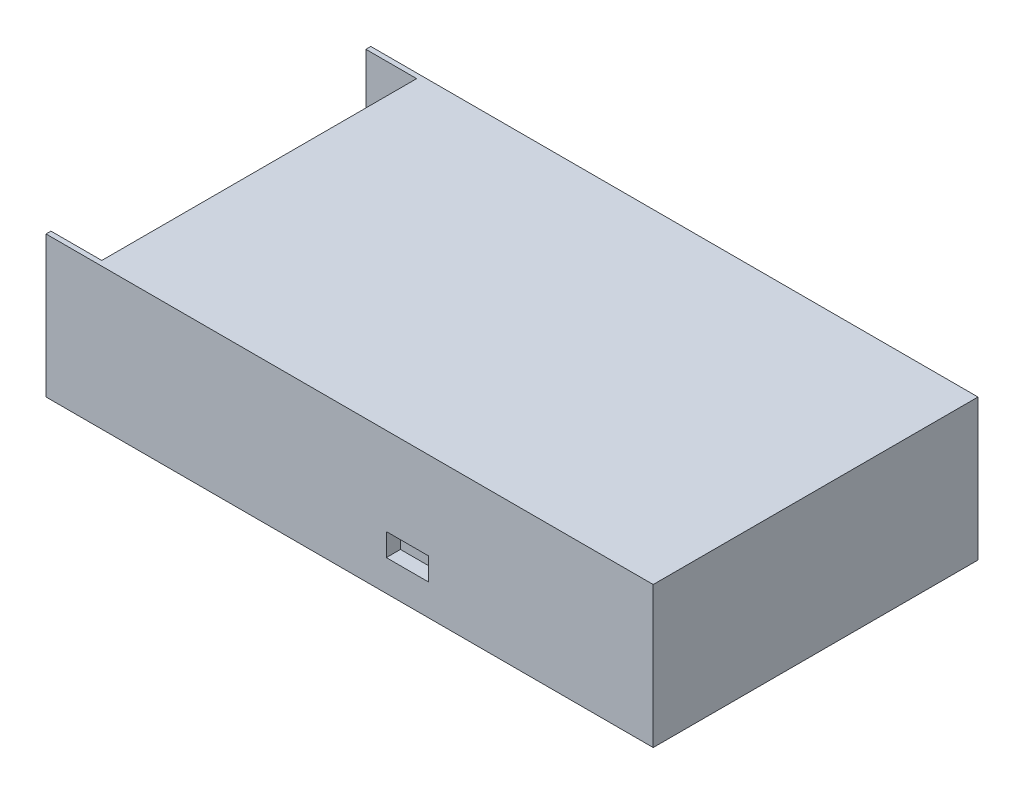
ISO-10303-21;
HEADER;
FILE_DESCRIPTION(('STEP AP214'),'2;1');
FILE_NAME('part.step','',(''),(''),'','','');
FILE_SCHEMA(('AUTOMOTIVE_DESIGN { 1 0 10303 214 1 1 1 1 }'));
ENDSEC;
DATA;
#1=APPLICATION_CONTEXT('core data for automotive mechanical design processes');
#2=APPLICATION_PROTOCOL_DEFINITION('international standard','automotive_design',2000,#1);
#3=PRODUCT_CONTEXT('',#1,'mechanical');
#4=PRODUCT('Part','Part','',(#3));
#5=PRODUCT_RELATED_PRODUCT_CATEGORY('part','',(#4));
#6=PRODUCT_DEFINITION_FORMATION('','',#4);
#7=PRODUCT_DEFINITION_CONTEXT('part definition',#1,'design');
#8=PRODUCT_DEFINITION('design','',#6,#7);
#9=PRODUCT_DEFINITION_SHAPE('','',#8);
#10=(LENGTH_UNIT() NAMED_UNIT(*) SI_UNIT(.MILLI.,.METRE.));
#11=(NAMED_UNIT(*) PLANE_ANGLE_UNIT() SI_UNIT($,.RADIAN.));
#12=(NAMED_UNIT(*) SI_UNIT($,.STERADIAN.) SOLID_ANGLE_UNIT());
#13=UNCERTAINTY_MEASURE_WITH_UNIT(LENGTH_MEASURE(1.E-05),#10,'distance_accuracy_value','');
#14=(GEOMETRIC_REPRESENTATION_CONTEXT(3) GLOBAL_UNCERTAINTY_ASSIGNED_CONTEXT((#13)) GLOBAL_UNIT_ASSIGNED_CONTEXT((#10,
#11,#12)) REPRESENTATION_CONTEXT('',''));
#15=CARTESIAN_POINT('',(0.,0.,0.));
#16=DIRECTION('',(0.,0.,1.));
#17=DIRECTION('',(1.,0.,0.));
#18=AXIS2_PLACEMENT_3D('',#15,#16,#17);
#19=CARTESIAN_POINT('',(-107.5,50.,-57.5));
#20=DIRECTION('',(1.,0.,0.));
#21=DIRECTION('',(0.,0.,-1.));
#22=AXIS2_PLACEMENT_3D('',#19,#20,#21);
#23=PLANE('',#22);
#24=DIRECTION('',(0.,0.,-1.));
#25=VECTOR('',#24,1.);
#26=CARTESIAN_POINT('',(-107.5,8.74999999999999,-55.75));
#27=LINE('',#26,#25);
#28=CARTESIAN_POINT('',(-107.5,8.74999999999999,55.75));
#29=VERTEX_POINT('',#28);
#30=CARTESIAN_POINT('',(-107.5,8.74999999999999,-55.75));
#31=VERTEX_POINT('',#30);
#32=EDGE_CURVE('E192',#29,#31,#27,.T.);
#33=ORIENTED_EDGE('',*,*,#32,.T.);
#34=DIRECTION('',(0.,1.,0.));
#35=VECTOR('',#34,1.);
#36=CARTESIAN_POINT('',(-107.5,-112.943569980765,-55.75));
#37=LINE('',#36,#35);
#38=CARTESIAN_POINT('',(-107.5,50.,-55.75));
#39=VERTEX_POINT('',#38);
#40=EDGE_CURVE('E190',#31,#39,#37,.T.);
#41=ORIENTED_EDGE('',*,*,#40,.T.);
#42=DIRECTION('',(0.,0.,1.));
#43=VECTOR('',#42,1.);
#44=CARTESIAN_POINT('',(-107.5,50.,-57.5));
#45=LINE('',#44,#43);
#46=CARTESIAN_POINT('',(-107.5,50.,-57.5));
#47=VERTEX_POINT('',#46);
#48=EDGE_CURVE('E211',#47,#39,#45,.T.);
#49=ORIENTED_EDGE('',*,*,#48,.F.);
#50=DIRECTION('',(0.,-1.,0.));
#51=VECTOR('',#50,1.);
#52=CARTESIAN_POINT('',(-107.5,50.,-57.5));
#53=LINE('',#52,#51);
#54=CARTESIAN_POINT('',(-107.5,0.,-57.5));
#55=VERTEX_POINT('',#54);
#56=EDGE_CURVE('E221',#47,#55,#53,.T.);
#57=ORIENTED_EDGE('',*,*,#56,.T.);
#58=DIRECTION('',(0.,0.,1.));
#59=VECTOR('',#58,1.);
#60=CARTESIAN_POINT('',(-107.5,0.,-57.5));
#61=LINE('',#60,#59);
#62=CARTESIAN_POINT('',(-107.5,0.,57.5));
#63=VERTEX_POINT('',#62);
#64=EDGE_CURVE('E210',#55,#63,#61,.T.);
#65=ORIENTED_EDGE('',*,*,#64,.T.);
#66=DIRECTION('',(0.,-1.,0.));
#67=VECTOR('',#66,1.);
#68=CARTESIAN_POINT('',(-107.5,50.,57.5));
#69=LINE('',#68,#67);
#70=CARTESIAN_POINT('',(-107.5,50.,57.5));
#71=VERTEX_POINT('',#70);
#72=EDGE_CURVE('E12',#71,#63,#69,.T.);
#73=ORIENTED_EDGE('',*,*,#72,.F.);
#74=CARTESIAN_POINT('',(-107.5,50.,55.75));
#75=VERTEX_POINT('',#74);
#76=EDGE_CURVE('E215',#75,#71,#45,.T.);
#77=ORIENTED_EDGE('',*,*,#76,.F.);
#78=DIRECTION('',(0.,1.,0.));
#79=VECTOR('',#78,1.);
#80=CARTESIAN_POINT('',(-107.5,-112.943569980765,55.75));
#81=LINE('',#80,#79);
#82=EDGE_CURVE('E57',#29,#75,#81,.T.);
#83=ORIENTED_EDGE('',*,*,#82,.F.);
#84=EDGE_LOOP('',(#33,#41,#49,#57,#65,#73,#77,#83));
#85=FACE_BOUND('',#84,.T.);
#86=ADVANCED_FACE('F35',(#85),#23,.F.);
#87=CARTESIAN_POINT('',(-107.5,50.,57.5));
#88=DIRECTION('',(0.,0.,-1.));
#89=DIRECTION('',(-1.,0.,0.));
#90=AXIS2_PLACEMENT_3D('',#87,#88,#89);
#91=PLANE('',#90);
#92=DIRECTION('',(1.,0.,0.));
#93=VECTOR('',#92,1.);
#94=CARTESIAN_POINT('',(13.,11.,57.5));
#95=LINE('',#94,#93);
#96=CARTESIAN_POINT('',(13.,11.,57.5));
#97=VERTEX_POINT('',#96);
#98=CARTESIAN_POINT('',(28.,11.,57.5));
#99=VERTEX_POINT('',#98);
#100=EDGE_CURVE('E153',#97,#99,#95,.T.);
#101=ORIENTED_EDGE('',*,*,#100,.F.);
#102=DIRECTION('',(0.,-1.,0.));
#103=VECTOR('',#102,1.);
#104=CARTESIAN_POINT('',(13.,19.,57.5));
#105=LINE('',#104,#103);
#106=CARTESIAN_POINT('',(13.,19.,57.5));
#107=VERTEX_POINT('',#106);
#108=EDGE_CURVE('E49',#107,#97,#105,.T.);
#109=ORIENTED_EDGE('',*,*,#108,.F.);
#110=DIRECTION('',(-1.,0.,0.));
#111=VECTOR('',#110,1.);
#112=CARTESIAN_POINT('',(13.,19.,57.5));
#113=LINE('',#112,#111);
#114=CARTESIAN_POINT('',(28.,19.,57.5));
#115=VERTEX_POINT('',#114);
#116=EDGE_CURVE('E144',#115,#107,#113,.T.);
#117=ORIENTED_EDGE('',*,*,#116,.F.);
#118=DIRECTION('',(0.,1.,0.));
#119=VECTOR('',#118,1.);
#120=CARTESIAN_POINT('',(28.,19.,57.5));
#121=LINE('',#120,#119);
#122=EDGE_CURVE('E147',#99,#115,#121,.T.);
#123=ORIENTED_EDGE('',*,*,#122,.F.);
#124=EDGE_LOOP('',(#101,#109,#117,#123));
#125=FACE_BOUND('',#124,.T.);
#126=DIRECTION('',(1.,0.,0.));
#127=VECTOR('',#126,1.);
#128=CARTESIAN_POINT('',(-107.5,0.,57.5));
#129=LINE('',#128,#127);
#130=CARTESIAN_POINT('',(107.5,0.,57.5));
#131=VERTEX_POINT('',#130);
#132=EDGE_CURVE('E224',#63,#131,#129,.T.);
#133=ORIENTED_EDGE('',*,*,#132,.T.);
#134=DIRECTION('',(0.,-1.,0.));
#135=VECTOR('',#134,1.);
#136=CARTESIAN_POINT('',(107.5,50.,57.5));
#137=LINE('',#136,#135);
#138=CARTESIAN_POINT('',(107.5,50.,57.5));
#139=VERTEX_POINT('',#138);
#140=EDGE_CURVE('E42',#139,#131,#137,.T.);
#141=ORIENTED_EDGE('',*,*,#140,.F.);
#142=DIRECTION('',(1.,0.,0.));
#143=VECTOR('',#142,1.);
#144=CARTESIAN_POINT('',(-107.5,50.,57.5));
#145=LINE('',#144,#143);
#146=EDGE_CURVE('E214',#71,#139,#145,.T.);
#147=ORIENTED_EDGE('',*,*,#146,.F.);
#148=ORIENTED_EDGE('',*,*,#72,.T.);
#149=EDGE_LOOP('',(#133,#141,#147,#148));
#150=FACE_BOUND('',#149,.T.);
#151=ADVANCED_FACE('F260',(#125,#150),#91,.F.);
#152=CARTESIAN_POINT('',(107.5,50.,-57.5));
#153=DIRECTION('',(-1.,0.,0.));
#154=DIRECTION('',(0.,0.,1.));
#155=AXIS2_PLACEMENT_3D('',#152,#153,#154);
#156=PLANE('',#155);
#157=DIRECTION('',(0.,0.,-1.));
#158=VECTOR('',#157,1.);
#159=CARTESIAN_POINT('',(107.5,0.,-57.5));
#160=LINE('',#159,#158);
#161=CARTESIAN_POINT('',(107.5,0.,-57.5));
#162=VERTEX_POINT('',#161);
#163=EDGE_CURVE('E226',#131,#162,#160,.T.);
#164=ORIENTED_EDGE('',*,*,#163,.T.);
#165=DIRECTION('',(0.,-1.,0.));
#166=VECTOR('',#165,1.);
#167=CARTESIAN_POINT('',(107.5,50.,-57.5));
#168=LINE('',#167,#166);
#169=CARTESIAN_POINT('',(107.5,50.,-57.5));
#170=VERTEX_POINT('',#169);
#171=EDGE_CURVE('E232',#170,#162,#168,.T.);
#172=ORIENTED_EDGE('',*,*,#171,.F.);
#173=DIRECTION('',(0.,0.,-1.));
#174=VECTOR('',#173,1.);
#175=CARTESIAN_POINT('',(107.5,50.,-57.5));
#176=LINE('',#175,#174);
#177=EDGE_CURVE('E217',#139,#170,#176,.T.);
#178=ORIENTED_EDGE('',*,*,#177,.F.);
#179=ORIENTED_EDGE('',*,*,#140,.T.);
#180=EDGE_LOOP('',(#164,#172,#178,#179));
#181=FACE_BOUND('',#180,.T.);
#182=ADVANCED_FACE('F239',(#181),#156,.F.);
#183=CARTESIAN_POINT('',(-107.5,50.,-57.5));
#184=DIRECTION('',(0.,0.,1.));
#185=DIRECTION('',(1.,0.,0.));
#186=AXIS2_PLACEMENT_3D('',#183,#184,#185);
#187=PLANE('',#186);
#188=DIRECTION('',(-1.,0.,0.));
#189=VECTOR('',#188,1.);
#190=CARTESIAN_POINT('',(-107.5,0.,-57.5));
#191=LINE('',#190,#189);
#192=EDGE_CURVE('E228',#162,#55,#191,.T.);
#193=ORIENTED_EDGE('',*,*,#192,.T.);
#194=ORIENTED_EDGE('',*,*,#56,.F.);
#195=DIRECTION('',(-1.,0.,0.));
#196=VECTOR('',#195,1.);
#197=CARTESIAN_POINT('',(-107.5,50.,-57.5));
#198=LINE('',#197,#196);
#199=EDGE_CURVE('E219',#170,#47,#198,.T.);
#200=ORIENTED_EDGE('',*,*,#199,.F.);
#201=ORIENTED_EDGE('',*,*,#171,.T.);
#202=EDGE_LOOP('',(#193,#194,#200,#201));
#203=FACE_BOUND('',#202,.T.);
#204=ADVANCED_FACE('F249',(#203),#187,.F.);
#205=CARTESIAN_POINT('',(-107.5,50.,57.5));
#206=DIRECTION('',(0.,1.,0.));
#207=DIRECTION('',(0.,0.,1.));
#208=AXIS2_PLACEMENT_3D('',#205,#206,#207);
#209=PLANE('',#208);
#210=DIRECTION('',(-1.,0.,0.));
#211=VECTOR('',#210,1.);
#212=CARTESIAN_POINT('',(-107.5,50.,-55.75));
#213=LINE('',#212,#211);
#214=CARTESIAN_POINT('',(-89.5,50.,-55.75));
#215=VERTEX_POINT('',#214);
#216=EDGE_CURVE('E200',#215,#39,#213,.T.);
#217=ORIENTED_EDGE('',*,*,#216,.F.);
#218=DIRECTION('',(0.,0.,-1.));
#219=VECTOR('',#218,1.);
#220=CARTESIAN_POINT('',(-89.5,50.,-55.75));
#221=LINE('',#220,#219);
#222=CARTESIAN_POINT('',(-89.5,50.,55.75));
#223=VERTEX_POINT('',#222);
#224=EDGE_CURVE('E197',#223,#215,#221,.T.);
#225=ORIENTED_EDGE('',*,*,#224,.F.);
#226=DIRECTION('',(1.,0.,0.));
#227=VECTOR('',#226,1.);
#228=CARTESIAN_POINT('',(-107.5,50.,55.75));
#229=LINE('',#228,#227);
#230=EDGE_CURVE('E184',#75,#223,#229,.T.);
#231=ORIENTED_EDGE('',*,*,#230,.F.);
#232=ORIENTED_EDGE('',*,*,#76,.T.);
#233=ORIENTED_EDGE('',*,*,#146,.T.);
#234=ORIENTED_EDGE('',*,*,#177,.T.);
#235=ORIENTED_EDGE('',*,*,#199,.T.);
#236=ORIENTED_EDGE('',*,*,#48,.T.);
#237=EDGE_LOOP('',(#217,#225,#231,#232,#233,#234,#235,#236));
#238=FACE_BOUND('',#237,.T.);
#239=ADVANCED_FACE('F257',(#238),#209,.T.);
#240=CARTESIAN_POINT('',(-107.5,0.,57.5));
#241=DIRECTION('',(0.,1.,0.));
#242=DIRECTION('',(0.,0.,1.));
#243=AXIS2_PLACEMENT_3D('',#240,#241,#242);
#244=PLANE('',#243);
#245=CARTESIAN_POINT('',(75.,0.,25.));
#246=DIRECTION('',(0.,-1.,0.));
#247=DIRECTION('',(0.,0.,-1.));
#248=AXIS2_PLACEMENT_3D('',#245,#246,#247);
#249=CIRCLE('',#248,2.);
#250=CARTESIAN_POINT('',(75.,0.,23.));
#251=VERTEX_POINT('',#250);
#252=EDGE_CURVE('E159',#251,#251,#249,.T.);
#253=ORIENTED_EDGE('',*,*,#252,.F.);
#254=EDGE_LOOP('',(#253));
#255=FACE_BOUND('',#254,.T.);
#256=CARTESIAN_POINT('',(75.,0.,-25.));
#257=DIRECTION('',(0.,-1.,0.));
#258=DIRECTION('',(0.,0.,-1.));
#259=AXIS2_PLACEMENT_3D('',#256,#257,#258);
#260=CIRCLE('',#259,2.);
#261=CARTESIAN_POINT('',(75.,0.,-27.));
#262=VERTEX_POINT('',#261);
#263=EDGE_CURVE('E166',#262,#262,#260,.T.);
#264=ORIENTED_EDGE('',*,*,#263,.F.);
#265=EDGE_LOOP('',(#264));
#266=FACE_BOUND('',#265,.T.);
#267=CARTESIAN_POINT('',(-75.,0.,25.));
#268=DIRECTION('',(0.,-1.,0.));
#269=DIRECTION('',(0.,0.,-1.));
#270=AXIS2_PLACEMENT_3D('',#267,#268,#269);
#271=CIRCLE('',#270,2.);
#272=CARTESIAN_POINT('',(-75.,0.,23.));
#273=VERTEX_POINT('',#272);
#274=EDGE_CURVE('E172',#273,#273,#271,.T.);
#275=ORIENTED_EDGE('',*,*,#274,.F.);
#276=EDGE_LOOP('',(#275));
#277=FACE_BOUND('',#276,.T.);
#278=CARTESIAN_POINT('',(-75.,0.,-25.));
#279=DIRECTION('',(0.,-1.,0.));
#280=DIRECTION('',(0.,0.,-1.));
#281=AXIS2_PLACEMENT_3D('',#278,#279,#280);
#282=CIRCLE('',#281,2.);
#283=CARTESIAN_POINT('',(-75.,0.,-27.));
#284=VERTEX_POINT('',#283);
#285=EDGE_CURVE('E178',#284,#284,#282,.T.);
#286=ORIENTED_EDGE('',*,*,#285,.F.);
#287=EDGE_LOOP('',(#286));
#288=FACE_BOUND('',#287,.T.);
#289=ORIENTED_EDGE('',*,*,#64,.F.);
#290=ORIENTED_EDGE('',*,*,#192,.F.);
#291=ORIENTED_EDGE('',*,*,#163,.F.);
#292=ORIENTED_EDGE('',*,*,#132,.F.);
#293=EDGE_LOOP('',(#289,#290,#291,#292));
#294=FACE_BOUND('',#293,.T.);
#295=ADVANCED_FACE('F246',(#255,#266,#277,#288,#294),#244,.F.);
#296=CARTESIAN_POINT('',(-107.5,-112.943569980765,-55.75));
#297=DIRECTION('',(0.,0.,-1.));
#298=DIRECTION('',(-1.,0.,0.));
#299=AXIS2_PLACEMENT_3D('',#296,#297,#298);
#300=PLANE('',#299);
#301=DIRECTION('',(1.,0.,0.));
#302=VECTOR('',#301,1.);
#303=CARTESIAN_POINT('',(-107.5,8.74999999999999,-55.75));
#304=LINE('',#303,#302);
#305=CARTESIAN_POINT('',(-89.5,8.74999999999999,-55.75));
#306=VERTEX_POINT('',#305);
#307=EDGE_CURVE('E189',#31,#306,#304,.T.);
#308=ORIENTED_EDGE('',*,*,#307,.T.);
#309=DIRECTION('',(0.,1.,0.));
#310=VECTOR('',#309,1.);
#311=CARTESIAN_POINT('',(-89.5,-112.943569980765,-55.75));
#312=LINE('',#311,#310);
#313=EDGE_CURVE('E204',#306,#215,#312,.T.);
#314=ORIENTED_EDGE('',*,*,#313,.T.);
#315=ORIENTED_EDGE('',*,*,#216,.T.);
#316=ORIENTED_EDGE('',*,*,#40,.F.);
#317=EDGE_LOOP('',(#308,#314,#315,#316));
#318=FACE_BOUND('',#317,.T.);
#319=ADVANCED_FACE('F268',(#318),#300,.F.);
#320=CARTESIAN_POINT('',(-89.5,-112.943569980765,-55.75));
#321=DIRECTION('',(1.,0.,0.));
#322=DIRECTION('',(0.,0.,-1.));
#323=AXIS2_PLACEMENT_3D('',#320,#321,#322);
#324=PLANE('',#323);
#325=DIRECTION('',(0.,0.,1.));
#326=VECTOR('',#325,1.);
#327=CARTESIAN_POINT('',(-89.5,8.74999999999999,-55.75));
#328=LINE('',#327,#326);
#329=CARTESIAN_POINT('',(-89.5,8.74999999999999,55.75));
#330=VERTEX_POINT('',#329);
#331=EDGE_CURVE('E187',#306,#330,#328,.T.);
#332=ORIENTED_EDGE('',*,*,#331,.T.);
#333=DIRECTION('',(0.,1.,0.));
#334=VECTOR('',#333,1.);
#335=CARTESIAN_POINT('',(-89.5,-112.943569980765,55.75));
#336=LINE('',#335,#334);
#337=EDGE_CURVE('E206',#330,#223,#336,.T.);
#338=ORIENTED_EDGE('',*,*,#337,.T.);
#339=ORIENTED_EDGE('',*,*,#224,.T.);
#340=ORIENTED_EDGE('',*,*,#313,.F.);
#341=EDGE_LOOP('',(#332,#338,#339,#340));
#342=FACE_BOUND('',#341,.T.);
#343=ADVANCED_FACE('F270',(#342),#324,.F.);
#344=CARTESIAN_POINT('',(-107.5,-112.943569980765,55.75));
#345=DIRECTION('',(0.,0.,1.));
#346=DIRECTION('',(1.,0.,0.));
#347=AXIS2_PLACEMENT_3D('',#344,#345,#346);
#348=PLANE('',#347);
#349=DIRECTION('',(-1.,0.,0.));
#350=VECTOR('',#349,1.);
#351=CARTESIAN_POINT('',(-107.5,8.74999999999999,55.75));
#352=LINE('',#351,#350);
#353=EDGE_CURVE('E195',#330,#29,#352,.T.);
#354=ORIENTED_EDGE('',*,*,#353,.T.);
#355=ORIENTED_EDGE('',*,*,#82,.T.);
#356=ORIENTED_EDGE('',*,*,#230,.T.);
#357=ORIENTED_EDGE('',*,*,#337,.F.);
#358=EDGE_LOOP('',(#354,#355,#356,#357));
#359=FACE_BOUND('',#358,.T.);
#360=ADVANCED_FACE('F272',(#359),#348,.F.);
#361=CARTESIAN_POINT('',(-107.5,8.75,57.5));
#362=DIRECTION('',(0.,1.,0.));
#363=DIRECTION('',(0.,0.,1.));
#364=AXIS2_PLACEMENT_3D('',#361,#362,#363);
#365=PLANE('',#364);
#366=ORIENTED_EDGE('',*,*,#32,.F.);
#367=ORIENTED_EDGE('',*,*,#353,.F.);
#368=ORIENTED_EDGE('',*,*,#331,.F.);
#369=ORIENTED_EDGE('',*,*,#307,.F.);
#370=EDGE_LOOP('',(#366,#367,#368,#369));
#371=FACE_BOUND('',#370,.T.);
#372=ADVANCED_FACE('F264',(#371),#365,.T.);
#373=CARTESIAN_POINT('',(-75.,5.,-25.));
#374=DIRECTION('',(0.,-1.,0.));
#375=DIRECTION('',(0.,0.,-1.));
#376=AXIS2_PLACEMENT_3D('',#373,#374,#375);
#377=CYLINDRICAL_SURFACE('',#376,2.);
#378=CARTESIAN_POINT('',(-75.,5.,-25.));
#379=DIRECTION('',(0.,-1.,0.));
#380=DIRECTION('',(0.,0.,-1.));
#381=AXIS2_PLACEMENT_3D('',#378,#379,#380);
#382=CIRCLE('',#381,2.);
#383=CARTESIAN_POINT('',(-75.,5.,-27.));
#384=VERTEX_POINT('',#383);
#385=EDGE_CURVE('E181',#384,#384,#382,.T.);
#386=ORIENTED_EDGE('',*,*,#385,.F.);
#387=EDGE_LOOP('',(#386));
#388=FACE_BOUND('',#387,.T.);
#389=ORIENTED_EDGE('',*,*,#285,.T.);
#390=EDGE_LOOP('',(#389));
#391=FACE_BOUND('',#390,.T.);
#392=ADVANCED_FACE('F279',(#388,#391),#377,.F.);
#393=CARTESIAN_POINT('',(-75.,5.,-25.));
#394=DIRECTION('',(0.,-1.,0.));
#395=DIRECTION('',(0.,0.,-1.));
#396=AXIS2_PLACEMENT_3D('',#393,#394,#395);
#397=PLANE('',#396);
#398=ORIENTED_EDGE('',*,*,#385,.T.);
#399=EDGE_LOOP('',(#398));
#400=FACE_BOUND('',#399,.T.);
#401=ADVANCED_FACE('F335',(#400),#397,.T.);
#402=CARTESIAN_POINT('',(-75.,5.,25.));
#403=DIRECTION('',(0.,-1.,0.));
#404=DIRECTION('',(0.,0.,-1.));
#405=AXIS2_PLACEMENT_3D('',#402,#403,#404);
#406=CYLINDRICAL_SURFACE('',#405,2.);
#407=CARTESIAN_POINT('',(-75.,5.,25.));
#408=DIRECTION('',(0.,-1.,0.));
#409=DIRECTION('',(0.,0.,-1.));
#410=AXIS2_PLACEMENT_3D('',#407,#408,#409);
#411=CIRCLE('',#410,2.);
#412=CARTESIAN_POINT('',(-75.,5.,23.));
#413=VERTEX_POINT('',#412);
#414=EDGE_CURVE('E175',#413,#413,#411,.T.);
#415=ORIENTED_EDGE('',*,*,#414,.F.);
#416=EDGE_LOOP('',(#415));
#417=FACE_BOUND('',#416,.T.);
#418=ORIENTED_EDGE('',*,*,#274,.T.);
#419=EDGE_LOOP('',(#418));
#420=FACE_BOUND('',#419,.T.);
#421=ADVANCED_FACE('F342',(#417,#420),#406,.F.);
#422=CARTESIAN_POINT('',(-75.,5.,25.));
#423=DIRECTION('',(0.,-1.,0.));
#424=DIRECTION('',(0.,0.,-1.));
#425=AXIS2_PLACEMENT_3D('',#422,#423,#424);
#426=PLANE('',#425);
#427=ORIENTED_EDGE('',*,*,#414,.T.);
#428=EDGE_LOOP('',(#427));
#429=FACE_BOUND('',#428,.T.);
#430=ADVANCED_FACE('F350',(#429),#426,.T.);
#431=CARTESIAN_POINT('',(75.,5.,-25.));
#432=DIRECTION('',(0.,-1.,0.));
#433=DIRECTION('',(0.,0.,-1.));
#434=AXIS2_PLACEMENT_3D('',#431,#432,#433);
#435=CYLINDRICAL_SURFACE('',#434,2.);
#436=CARTESIAN_POINT('',(75.,5.,-25.));
#437=DIRECTION('',(0.,-1.,0.));
#438=DIRECTION('',(0.,0.,-1.));
#439=AXIS2_PLACEMENT_3D('',#436,#437,#438);
#440=CIRCLE('',#439,2.);
#441=CARTESIAN_POINT('',(75.,5.,-27.));
#442=VERTEX_POINT('',#441);
#443=EDGE_CURVE('E169',#442,#442,#440,.T.);
#444=ORIENTED_EDGE('',*,*,#443,.F.);
#445=EDGE_LOOP('',(#444));
#446=FACE_BOUND('',#445,.T.);
#447=ORIENTED_EDGE('',*,*,#263,.T.);
#448=EDGE_LOOP('',(#447));
#449=FACE_BOUND('',#448,.T.);
#450=ADVANCED_FACE('F358',(#446,#449),#435,.F.);
#451=CARTESIAN_POINT('',(75.,5.,-25.));
#452=DIRECTION('',(0.,-1.,0.));
#453=DIRECTION('',(0.,0.,-1.));
#454=AXIS2_PLACEMENT_3D('',#451,#452,#453);
#455=PLANE('',#454);
#456=ORIENTED_EDGE('',*,*,#443,.T.);
#457=EDGE_LOOP('',(#456));
#458=FACE_BOUND('',#457,.T.);
#459=ADVANCED_FACE('F366',(#458),#455,.T.);
#460=CARTESIAN_POINT('',(75.,5.,25.));
#461=DIRECTION('',(0.,-1.,0.));
#462=DIRECTION('',(0.,0.,-1.));
#463=AXIS2_PLACEMENT_3D('',#460,#461,#462);
#464=CYLINDRICAL_SURFACE('',#463,2.);
#465=CARTESIAN_POINT('',(75.,5.,25.));
#466=DIRECTION('',(0.,-1.,0.));
#467=DIRECTION('',(0.,0.,-1.));
#468=AXIS2_PLACEMENT_3D('',#465,#466,#467);
#469=CIRCLE('',#468,2.);
#470=CARTESIAN_POINT('',(75.,5.,23.));
#471=VERTEX_POINT('',#470);
#472=EDGE_CURVE('E163',#471,#471,#469,.T.);
#473=ORIENTED_EDGE('',*,*,#472,.F.);
#474=EDGE_LOOP('',(#473));
#475=FACE_BOUND('',#474,.T.);
#476=ORIENTED_EDGE('',*,*,#252,.T.);
#477=EDGE_LOOP('',(#476));
#478=FACE_BOUND('',#477,.T.);
#479=ADVANCED_FACE('F374',(#475,#478),#464,.F.);
#480=CARTESIAN_POINT('',(75.,5.,25.));
#481=DIRECTION('',(0.,-1.,0.));
#482=DIRECTION('',(0.,0.,-1.));
#483=AXIS2_PLACEMENT_3D('',#480,#481,#482);
#484=PLANE('',#483);
#485=ORIENTED_EDGE('',*,*,#472,.T.);
#486=EDGE_LOOP('',(#485));
#487=FACE_BOUND('',#486,.T.);
#488=ADVANCED_FACE('F382',(#487),#484,.T.);
#489=CARTESIAN_POINT('',(13.,19.,52.5));
#490=DIRECTION('',(-1.,0.,0.));
#491=DIRECTION('',(0.,-1.,0.));
#492=AXIS2_PLACEMENT_3D('',#489,#490,#491);
#493=PLANE('',#492);
#494=ORIENTED_EDGE('',*,*,#108,.T.);
#495=DIRECTION('',(0.,0.,1.));
#496=VECTOR('',#495,1.);
#497=CARTESIAN_POINT('',(13.,11.,52.5));
#498=LINE('',#497,#496);
#499=CARTESIAN_POINT('',(13.,11.,52.5));
#500=VERTEX_POINT('',#499);
#501=EDGE_CURVE('E122',#500,#97,#498,.T.);
#502=ORIENTED_EDGE('',*,*,#501,.F.);
#503=DIRECTION('',(0.,-1.,0.));
#504=VECTOR('',#503,1.);
#505=CARTESIAN_POINT('',(13.,19.,52.5));
#506=LINE('',#505,#504);
#507=CARTESIAN_POINT('',(13.,19.,52.5));
#508=VERTEX_POINT('',#507);
#509=EDGE_CURVE('E126',#508,#500,#506,.T.);
#510=ORIENTED_EDGE('',*,*,#509,.F.);
#511=DIRECTION('',(0.,0.,1.));
#512=VECTOR('',#511,1.);
#513=CARTESIAN_POINT('',(13.,19.,52.5));
#514=LINE('',#513,#512);
#515=EDGE_CURVE('E157',#508,#107,#514,.T.);
#516=ORIENTED_EDGE('',*,*,#515,.T.);
#517=EDGE_LOOP('',(#494,#502,#510,#516));
#518=FACE_BOUND('',#517,.T.);
#519=ADVANCED_FACE('F124',(#518),#493,.F.);
#520=CARTESIAN_POINT('',(13.,19.,52.5));
#521=DIRECTION('',(0.,1.,0.));
#522=DIRECTION('',(0.,0.,1.));
#523=AXIS2_PLACEMENT_3D('',#520,#521,#522);
#524=PLANE('',#523);
#525=ORIENTED_EDGE('',*,*,#116,.T.);
#526=ORIENTED_EDGE('',*,*,#515,.F.);
#527=DIRECTION('',(-1.,0.,0.));
#528=VECTOR('',#527,1.);
#529=CARTESIAN_POINT('',(13.,19.,52.5));
#530=LINE('',#529,#528);
#531=CARTESIAN_POINT('',(28.,19.,52.5));
#532=VERTEX_POINT('',#531);
#533=EDGE_CURVE('E132',#532,#508,#530,.T.);
#534=ORIENTED_EDGE('',*,*,#533,.F.);
#535=DIRECTION('',(0.,0.,1.));
#536=VECTOR('',#535,1.);
#537=CARTESIAN_POINT('',(28.,19.,52.5));
#538=LINE('',#537,#536);
#539=EDGE_CURVE('E160',#532,#115,#538,.T.);
#540=ORIENTED_EDGE('',*,*,#539,.T.);
#541=EDGE_LOOP('',(#525,#526,#534,#540));
#542=FACE_BOUND('',#541,.T.);
#543=ADVANCED_FACE('F397',(#542),#524,.F.);
#544=CARTESIAN_POINT('',(28.,19.,52.5));
#545=DIRECTION('',(1.,0.,0.));
#546=DIRECTION('',(0.,0.,-1.));
#547=AXIS2_PLACEMENT_3D('',#544,#545,#546);
#548=PLANE('',#547);
#549=ORIENTED_EDGE('',*,*,#122,.T.);
#550=ORIENTED_EDGE('',*,*,#539,.F.);
#551=DIRECTION('',(0.,1.,0.));
#552=VECTOR('',#551,1.);
#553=CARTESIAN_POINT('',(28.,19.,52.5));
#554=LINE('',#553,#552);
#555=CARTESIAN_POINT('',(28.,11.,52.5));
#556=VERTEX_POINT('',#555);
#557=EDGE_CURVE('E140',#556,#532,#554,.T.);
#558=ORIENTED_EDGE('',*,*,#557,.F.);
#559=DIRECTION('',(0.,0.,1.));
#560=VECTOR('',#559,1.);
#561=CARTESIAN_POINT('',(28.,11.,52.5));
#562=LINE('',#561,#560);
#563=EDGE_CURVE('E131',#556,#99,#562,.T.);
#564=ORIENTED_EDGE('',*,*,#563,.T.);
#565=EDGE_LOOP('',(#549,#550,#558,#564));
#566=FACE_BOUND('',#565,.T.);
#567=ADVANCED_FACE('F404',(#566),#548,.F.);
#568=CARTESIAN_POINT('',(13.,11.,52.5));
#569=DIRECTION('',(0.,-1.,0.));
#570=DIRECTION('',(0.,0.,-1.));
#571=AXIS2_PLACEMENT_3D('',#568,#569,#570);
#572=PLANE('',#571);
#573=ORIENTED_EDGE('',*,*,#100,.T.);
#574=ORIENTED_EDGE('',*,*,#563,.F.);
#575=DIRECTION('',(1.,0.,0.));
#576=VECTOR('',#575,1.);
#577=CARTESIAN_POINT('',(13.,11.,52.5));
#578=LINE('',#577,#576);
#579=EDGE_CURVE('E135',#500,#556,#578,.T.);
#580=ORIENTED_EDGE('',*,*,#579,.F.);
#581=ORIENTED_EDGE('',*,*,#501,.T.);
#582=EDGE_LOOP('',(#573,#574,#580,#581));
#583=FACE_BOUND('',#582,.T.);
#584=ADVANCED_FACE('F136',(#583),#572,.F.);
#585=CARTESIAN_POINT('',(13.,11.,52.5));
#586=DIRECTION('',(0.,0.,1.));
#587=DIRECTION('',(1.,0.,0.));
#588=AXIS2_PLACEMENT_3D('',#585,#586,#587);
#589=PLANE('',#588);
#590=ORIENTED_EDGE('',*,*,#509,.T.);
#591=ORIENTED_EDGE('',*,*,#579,.T.);
#592=ORIENTED_EDGE('',*,*,#557,.T.);
#593=ORIENTED_EDGE('',*,*,#533,.T.);
#594=EDGE_LOOP('',(#590,#591,#592,#593));
#595=FACE_BOUND('',#594,.T.);
#596=ADVANCED_FACE('F142',(#595),#589,.T.);
#597=CLOSED_SHELL('',(#86,#151,#182,#204,#239,#295,#319,#343,#360,#372,#392,#401,#421,#430,#450,
#459,#479,#488,#519,#543,#567,#584,#596));
#598=MANIFOLD_SOLID_BREP('B2',#597);
#599=ADVANCED_BREP_SHAPE_REPRESENTATION('',(#18,#598),#14);
#600=SHAPE_DEFINITION_REPRESENTATION(#9,#599);
ENDSEC;
END-ISO-10303-21;
